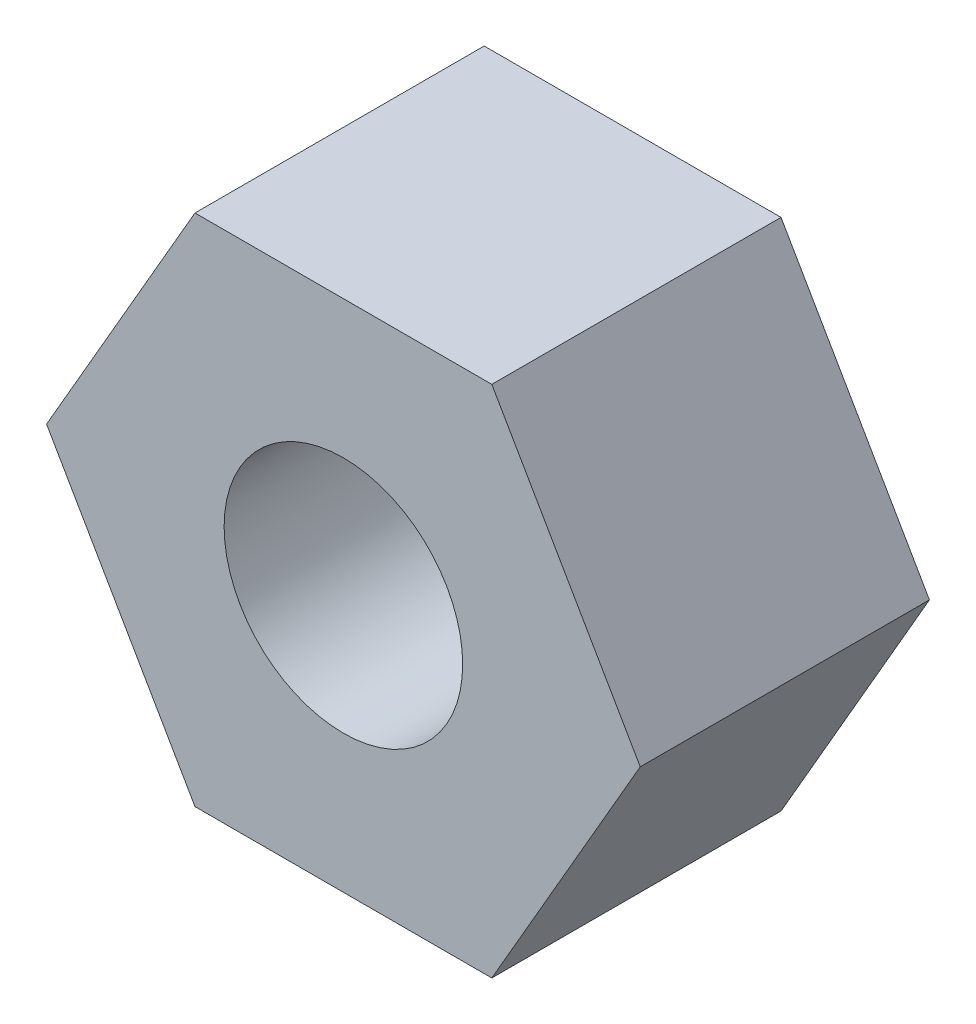
ISO-10303-21;
HEADER;
FILE_DESCRIPTION(('STEP AP214'),'2;1');
FILE_NAME('part.step','',(''),(''),'','','');
FILE_SCHEMA(('AUTOMOTIVE_DESIGN { 1 0 10303 214 1 1 1 1 }'));
ENDSEC;
DATA;
#1=APPLICATION_CONTEXT('core data for automotive mechanical design processes');
#2=APPLICATION_PROTOCOL_DEFINITION('international standard','automotive_design',2000,#1);
#3=PRODUCT_CONTEXT('',#1,'mechanical');
#4=PRODUCT('Part','Part','',(#3));
#5=PRODUCT_RELATED_PRODUCT_CATEGORY('part','',(#4));
#6=PRODUCT_DEFINITION_FORMATION('','',#4);
#7=PRODUCT_DEFINITION_CONTEXT('part definition',#1,'design');
#8=PRODUCT_DEFINITION('design','',#6,#7);
#9=PRODUCT_DEFINITION_SHAPE('','',#8);
#10=(LENGTH_UNIT() NAMED_UNIT(*) SI_UNIT(.MILLI.,.METRE.));
#11=(NAMED_UNIT(*) PLANE_ANGLE_UNIT() SI_UNIT($,.RADIAN.));
#12=(NAMED_UNIT(*) SI_UNIT($,.STERADIAN.) SOLID_ANGLE_UNIT());
#13=UNCERTAINTY_MEASURE_WITH_UNIT(LENGTH_MEASURE(1.E-05),#10,'distance_accuracy_value','');
#14=(GEOMETRIC_REPRESENTATION_CONTEXT(3) GLOBAL_UNCERTAINTY_ASSIGNED_CONTEXT((#13)) GLOBAL_UNIT_ASSIGNED_CONTEXT((#10,
#11,#12)) REPRESENTATION_CONTEXT('',''));
#15=CARTESIAN_POINT('',(0.,0.,0.));
#16=DIRECTION('',(0.,0.,1.));
#17=DIRECTION('',(1.,0.,0.));
#18=AXIS2_PLACEMENT_3D('',#15,#16,#17);
#19=CARTESIAN_POINT('',(3.66617420935412,0.,3.571875));
#20=DIRECTION('',(0.,0.,1.));
#21=DIRECTION('',(1.,0.,0.));
#22=AXIS2_PLACEMENT_3D('',#19,#20,#21);
#23=PLANE('',#22);
#24=DIRECTION('',(0.499999999999999,0.866025403784439,0.));
#25=VECTOR('',#24,1.);
#26=CARTESIAN_POINT('',(1.83308710467706,-3.17500000000001,3.571875));
#27=LINE('',#26,#25);
#28=CARTESIAN_POINT('',(1.83308710467706,-3.17500000000001,3.571875));
#29=VERTEX_POINT('',#28);
#30=CARTESIAN_POINT('',(3.66617420935412,0.,3.571875));
#31=VERTEX_POINT('',#30);
#32=EDGE_CURVE('E130',#29,#31,#27,.T.);
#33=ORIENTED_EDGE('',*,*,#32,.T.);
#34=DIRECTION('',(-0.5,0.866025403784439,0.));
#35=VECTOR('',#34,1.);
#36=CARTESIAN_POINT('',(3.66617420935412,0.,3.571875));
#37=LINE('',#36,#35);
#38=CARTESIAN_POINT('',(1.83308710467705,3.17500000000001,3.571875));
#39=VERTEX_POINT('',#38);
#40=EDGE_CURVE('E88',#31,#39,#37,.T.);
#41=ORIENTED_EDGE('',*,*,#40,.T.);
#42=DIRECTION('',(-1.,0.,0.));
#43=VECTOR('',#42,1.);
#44=CARTESIAN_POINT('',(1.83308710467705,3.17500000000001,3.571875));
#45=LINE('',#44,#43);
#46=CARTESIAN_POINT('',(-1.83308710467706,3.17500000000001,3.571875));
#47=VERTEX_POINT('',#46);
#48=EDGE_CURVE('E101',#39,#47,#45,.T.);
#49=ORIENTED_EDGE('',*,*,#48,.T.);
#50=DIRECTION('',(-0.5,-0.866025403784439,0.));
#51=VECTOR('',#50,1.);
#52=CARTESIAN_POINT('',(-1.83308710467706,3.17500000000001,3.571875));
#53=LINE('',#52,#51);
#54=CARTESIAN_POINT('',(-3.66617420935413,0.,3.571875));
#55=VERTEX_POINT('',#54);
#56=EDGE_CURVE('E95',#47,#55,#53,.T.);
#57=ORIENTED_EDGE('',*,*,#56,.T.);
#58=DIRECTION('',(0.499999999999999,-0.866025403784439,0.));
#59=VECTOR('',#58,1.);
#60=CARTESIAN_POINT('',(-3.66617420935413,0.,3.571875));
#61=LINE('',#60,#59);
#62=CARTESIAN_POINT('',(-1.83308710467707,-3.17500000000001,3.571875));
#63=VERTEX_POINT('',#62);
#64=EDGE_CURVE('E99',#55,#63,#61,.T.);
#65=ORIENTED_EDGE('',*,*,#64,.T.);
#66=DIRECTION('',(1.,0.,0.));
#67=VECTOR('',#66,1.);
#68=CARTESIAN_POINT('',(-1.83308710467707,-3.17500000000001,3.571875));
#69=LINE('',#68,#67);
#70=EDGE_CURVE('E51',#63,#29,#69,.T.);
#71=ORIENTED_EDGE('',*,*,#70,.T.);
#72=EDGE_LOOP('',(#33,#41,#49,#57,#65,#71));
#73=FACE_BOUND('',#72,.T.);
#74=CARTESIAN_POINT('',(0.,0.,3.571875));
#75=DIRECTION('',(0.,0.,1.));
#76=DIRECTION('',(1.,0.,0.));
#77=AXIS2_PLACEMENT_3D('',#74,#75,#76);
#78=CIRCLE('',#77,1.4732);
#79=CARTESIAN_POINT('',(1.4732,0.,3.571875));
#80=VERTEX_POINT('',#79);
#81=EDGE_CURVE('E123',#80,#80,#78,.T.);
#82=ORIENTED_EDGE('',*,*,#81,.F.);
#83=EDGE_LOOP('',(#82));
#84=FACE_BOUND('',#83,.T.);
#85=ADVANCED_FACE('F34',(#73,#84),#23,.T.);
#86=CARTESIAN_POINT('',(3.66617420935412,0.,0.));
#87=DIRECTION('',(0.,0.,1.));
#88=DIRECTION('',(1.,0.,0.));
#89=AXIS2_PLACEMENT_3D('',#86,#87,#88);
#90=PLANE('',#89);
#91=DIRECTION('',(0.499999999999999,0.866025403784439,0.));
#92=VECTOR('',#91,1.);
#93=CARTESIAN_POINT('',(1.83308710467706,-3.17500000000001,0.));
#94=LINE('',#93,#92);
#95=CARTESIAN_POINT('',(1.83308710467706,-3.17500000000001,0.));
#96=VERTEX_POINT('',#95);
#97=CARTESIAN_POINT('',(3.66617420935412,0.,0.));
#98=VERTEX_POINT('',#97);
#99=EDGE_CURVE('E119',#96,#98,#94,.T.);
#100=ORIENTED_EDGE('',*,*,#99,.F.);
#101=DIRECTION('',(1.,0.,0.));
#102=VECTOR('',#101,1.);
#103=CARTESIAN_POINT('',(-1.83308710467707,-3.17500000000001,0.));
#104=LINE('',#103,#102);
#105=CARTESIAN_POINT('',(-1.83308710467707,-3.17500000000001,0.));
#106=VERTEX_POINT('',#105);
#107=EDGE_CURVE('E80',#106,#96,#104,.T.);
#108=ORIENTED_EDGE('',*,*,#107,.F.);
#109=DIRECTION('',(0.499999999999999,-0.866025403784439,0.));
#110=VECTOR('',#109,1.);
#111=CARTESIAN_POINT('',(-3.66617420935413,0.,0.));
#112=LINE('',#111,#110);
#113=CARTESIAN_POINT('',(-3.66617420935413,0.,0.));
#114=VERTEX_POINT('',#113);
#115=EDGE_CURVE('E74',#114,#106,#112,.T.);
#116=ORIENTED_EDGE('',*,*,#115,.F.);
#117=DIRECTION('',(-0.5,-0.866025403784439,0.));
#118=VECTOR('',#117,1.);
#119=CARTESIAN_POINT('',(-1.83308710467706,3.17500000000001,0.));
#120=LINE('',#119,#118);
#121=CARTESIAN_POINT('',(-1.83308710467706,3.17500000000001,0.));
#122=VERTEX_POINT('',#121);
#123=EDGE_CURVE('E109',#122,#114,#120,.T.);
#124=ORIENTED_EDGE('',*,*,#123,.F.);
#125=DIRECTION('',(-1.,0.,0.));
#126=VECTOR('',#125,1.);
#127=CARTESIAN_POINT('',(1.83308710467705,3.17500000000001,0.));
#128=LINE('',#127,#126);
#129=CARTESIAN_POINT('',(1.83308710467705,3.17500000000001,0.));
#130=VERTEX_POINT('',#129);
#131=EDGE_CURVE('E125',#130,#122,#128,.T.);
#132=ORIENTED_EDGE('',*,*,#131,.F.);
#133=DIRECTION('',(-0.5,0.866025403784439,0.));
#134=VECTOR('',#133,1.);
#135=CARTESIAN_POINT('',(3.66617420935412,0.,0.));
#136=LINE('',#135,#134);
#137=EDGE_CURVE('E122',#98,#130,#136,.T.);
#138=ORIENTED_EDGE('',*,*,#137,.F.);
#139=EDGE_LOOP('',(#100,#108,#116,#124,#132,#138));
#140=FACE_BOUND('',#139,.T.);
#141=CARTESIAN_POINT('',(0.,0.,0.));
#142=DIRECTION('',(0.,0.,1.));
#143=DIRECTION('',(1.,0.,0.));
#144=AXIS2_PLACEMENT_3D('',#141,#142,#143);
#145=CIRCLE('',#144,1.4732);
#146=CARTESIAN_POINT('',(1.4732,0.,0.));
#147=VERTEX_POINT('',#146);
#148=EDGE_CURVE('E223',#147,#147,#145,.T.);
#149=ORIENTED_EDGE('',*,*,#148,.T.);
#150=EDGE_LOOP('',(#149));
#151=FACE_BOUND('',#150,.T.);
#152=ADVANCED_FACE('F139',(#140,#151),#90,.F.);
#153=CARTESIAN_POINT('',(1.83308710467706,-3.17500000000001,3.571875));
#154=DIRECTION('',(-0.866025403784439,0.499999999999999,0.));
#155=DIRECTION('',(-0.499999999999999,-0.866025403784439,0.));
#156=AXIS2_PLACEMENT_3D('',#153,#154,#155);
#157=PLANE('',#156);
#158=ORIENTED_EDGE('',*,*,#99,.T.);
#159=DIRECTION('',(0.,0.,-1.));
#160=VECTOR('',#159,1.);
#161=CARTESIAN_POINT('',(3.66617420935412,0.,3.571875));
#162=LINE('',#161,#160);
#163=EDGE_CURVE('E11',#31,#98,#162,.T.);
#164=ORIENTED_EDGE('',*,*,#163,.F.);
#165=ORIENTED_EDGE('',*,*,#32,.F.);
#166=DIRECTION('',(0.,0.,-1.));
#167=VECTOR('',#166,1.);
#168=CARTESIAN_POINT('',(1.83308710467706,-3.17500000000001,3.571875));
#169=LINE('',#168,#167);
#170=EDGE_CURVE('E115',#29,#96,#169,.T.);
#171=ORIENTED_EDGE('',*,*,#170,.T.);
#172=EDGE_LOOP('',(#158,#164,#165,#171));
#173=FACE_BOUND('',#172,.T.);
#174=ADVANCED_FACE('F36',(#173),#157,.F.);
#175=CARTESIAN_POINT('',(3.66617420935412,0.,3.571875));
#176=DIRECTION('',(-0.866025403784438,-0.5,0.));
#177=DIRECTION('',(0.5,-0.866025403784439,0.));
#178=AXIS2_PLACEMENT_3D('',#175,#176,#177);
#179=PLANE('',#178);
#180=ORIENTED_EDGE('',*,*,#137,.T.);
#181=DIRECTION('',(0.,0.,-1.));
#182=VECTOR('',#181,1.);
#183=CARTESIAN_POINT('',(1.83308710467705,3.17500000000001,3.571875));
#184=LINE('',#183,#182);
#185=EDGE_CURVE('E43',#39,#130,#184,.T.);
#186=ORIENTED_EDGE('',*,*,#185,.F.);
#187=ORIENTED_EDGE('',*,*,#40,.F.);
#188=ORIENTED_EDGE('',*,*,#163,.T.);
#189=EDGE_LOOP('',(#180,#186,#187,#188));
#190=FACE_BOUND('',#189,.T.);
#191=ADVANCED_FACE('F164',(#190),#179,.F.);
#192=CARTESIAN_POINT('',(1.83308710467705,3.17500000000001,3.571875));
#193=DIRECTION('',(0.,-1.,0.));
#194=DIRECTION('',(0.,0.,-1.));
#195=AXIS2_PLACEMENT_3D('',#192,#193,#194);
#196=PLANE('',#195);
#197=ORIENTED_EDGE('',*,*,#131,.T.);
#198=DIRECTION('',(0.,0.,-1.));
#199=VECTOR('',#198,1.);
#200=CARTESIAN_POINT('',(-1.83308710467706,3.17500000000001,3.571875));
#201=LINE('',#200,#199);
#202=EDGE_CURVE('E110',#47,#122,#201,.T.);
#203=ORIENTED_EDGE('',*,*,#202,.F.);
#204=ORIENTED_EDGE('',*,*,#48,.F.);
#205=ORIENTED_EDGE('',*,*,#185,.T.);
#206=EDGE_LOOP('',(#197,#203,#204,#205));
#207=FACE_BOUND('',#206,.T.);
#208=ADVANCED_FACE('F136',(#207),#196,.F.);
#209=CARTESIAN_POINT('',(-1.83308710467706,3.17500000000001,3.571875));
#210=DIRECTION('',(0.866025403784439,-0.5,0.));
#211=DIRECTION('',(0.5,0.866025403784439,0.));
#212=AXIS2_PLACEMENT_3D('',#209,#210,#211);
#213=PLANE('',#212);
#214=ORIENTED_EDGE('',*,*,#123,.T.);
#215=DIRECTION('',(0.,0.,-1.));
#216=VECTOR('',#215,1.);
#217=CARTESIAN_POINT('',(-3.66617420935413,0.,3.571875));
#218=LINE('',#217,#216);
#219=EDGE_CURVE('E106',#55,#114,#218,.T.);
#220=ORIENTED_EDGE('',*,*,#219,.F.);
#221=ORIENTED_EDGE('',*,*,#56,.F.);
#222=ORIENTED_EDGE('',*,*,#202,.T.);
#223=EDGE_LOOP('',(#214,#220,#221,#222));
#224=FACE_BOUND('',#223,.T.);
#225=ADVANCED_FACE('F107',(#224),#213,.F.);
#226=CARTESIAN_POINT('',(-3.66617420935413,0.,3.571875));
#227=DIRECTION('',(0.866025403784439,0.499999999999999,0.));
#228=DIRECTION('',(-0.499999999999999,0.866025403784439,0.));
#229=AXIS2_PLACEMENT_3D('',#226,#227,#228);
#230=PLANE('',#229);
#231=ORIENTED_EDGE('',*,*,#115,.T.);
#232=DIRECTION('',(0.,0.,-1.));
#233=VECTOR('',#232,1.);
#234=CARTESIAN_POINT('',(-1.83308710467707,-3.17500000000001,3.571875));
#235=LINE('',#234,#233);
#236=EDGE_CURVE('E111',#63,#106,#235,.T.);
#237=ORIENTED_EDGE('',*,*,#236,.F.);
#238=ORIENTED_EDGE('',*,*,#64,.F.);
#239=ORIENTED_EDGE('',*,*,#219,.T.);
#240=EDGE_LOOP('',(#231,#237,#238,#239));
#241=FACE_BOUND('',#240,.T.);
#242=ADVANCED_FACE('F113',(#241),#230,.F.);
#243=CARTESIAN_POINT('',(-1.83308710467707,-3.17500000000001,3.571875));
#244=DIRECTION('',(0.,1.,0.));
#245=DIRECTION('',(0.,0.,1.));
#246=AXIS2_PLACEMENT_3D('',#243,#244,#245);
#247=PLANE('',#246);
#248=ORIENTED_EDGE('',*,*,#107,.T.);
#249=ORIENTED_EDGE('',*,*,#170,.F.);
#250=ORIENTED_EDGE('',*,*,#70,.F.);
#251=ORIENTED_EDGE('',*,*,#236,.T.);
#252=EDGE_LOOP('',(#248,#249,#250,#251));
#253=FACE_BOUND('',#252,.T.);
#254=ADVANCED_FACE('F144',(#253),#247,.F.);
#255=CARTESIAN_POINT('',(0.,0.,3.571875));
#256=DIRECTION('',(0.,0.,-1.));
#257=DIRECTION('',(-1.,0.,0.));
#258=AXIS2_PLACEMENT_3D('',#255,#256,#257);
#259=CYLINDRICAL_SURFACE('',#258,1.4732);
#260=ORIENTED_EDGE('',*,*,#81,.T.);
#261=EDGE_LOOP('',(#260));
#262=FACE_BOUND('',#261,.T.);
#263=ORIENTED_EDGE('',*,*,#148,.F.);
#264=EDGE_LOOP('',(#263));
#265=FACE_BOUND('',#264,.T.);
#266=ADVANCED_FACE('F146',(#262,#265),#259,.F.);
#267=CLOSED_SHELL('',(#85,#152,#174,#191,#208,#225,#242,#254,#266));
#268=MANIFOLD_SOLID_BREP('B2',#267);
#269=ADVANCED_BREP_SHAPE_REPRESENTATION('',(#18,#268),#14);
#270=SHAPE_DEFINITION_REPRESENTATION(#9,#269);
ENDSEC;
END-ISO-10303-21;
